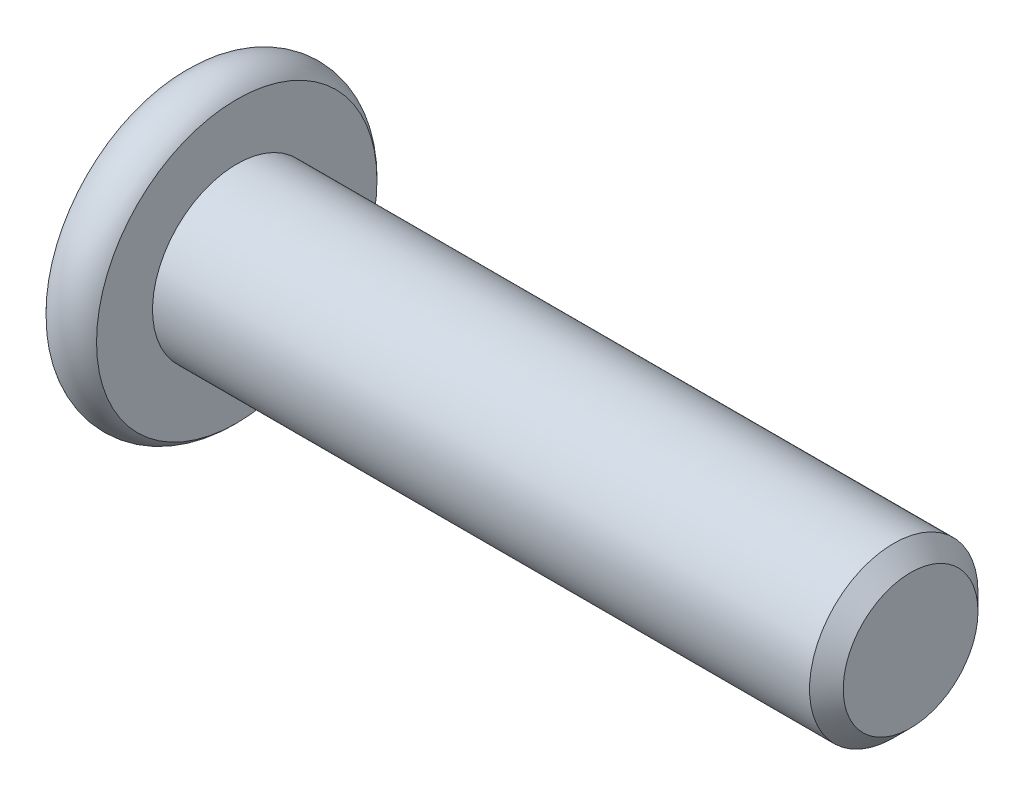
ISO-10303-21;
HEADER;
FILE_DESCRIPTION(('STEP AP214'),'2;1');
FILE_NAME('part.step','',(''),(''),'','','');
FILE_SCHEMA(('AUTOMOTIVE_DESIGN { 1 0 10303 214 1 1 1 1 }'));
ENDSEC;
DATA;
#1=APPLICATION_CONTEXT('core data for automotive mechanical design processes');
#2=APPLICATION_PROTOCOL_DEFINITION('international standard','automotive_design',2000,#1);
#3=PRODUCT_CONTEXT('',#1,'mechanical');
#4=PRODUCT('Part','Part','',(#3));
#5=PRODUCT_RELATED_PRODUCT_CATEGORY('part','',(#4));
#6=PRODUCT_DEFINITION_FORMATION('','',#4);
#7=PRODUCT_DEFINITION_CONTEXT('part definition',#1,'design');
#8=PRODUCT_DEFINITION('design','',#6,#7);
#9=PRODUCT_DEFINITION_SHAPE('','',#8);
#10=(LENGTH_UNIT() NAMED_UNIT(*) SI_UNIT(.MILLI.,.METRE.));
#11=(NAMED_UNIT(*) PLANE_ANGLE_UNIT() SI_UNIT($,.RADIAN.));
#12=(NAMED_UNIT(*) SI_UNIT($,.STERADIAN.) SOLID_ANGLE_UNIT());
#13=UNCERTAINTY_MEASURE_WITH_UNIT(LENGTH_MEASURE(1.E-05),#10,'distance_accuracy_value','');
#14=(GEOMETRIC_REPRESENTATION_CONTEXT(3) GLOBAL_UNCERTAINTY_ASSIGNED_CONTEXT((#13)) GLOBAL_UNIT_ASSIGNED_CONTEXT((#10,
#11,#12)) REPRESENTATION_CONTEXT('',''));
#15=CARTESIAN_POINT('',(0.,0.,0.));
#16=DIRECTION('',(0.,0.,1.));
#17=DIRECTION('',(1.,0.,0.));
#18=AXIS2_PLACEMENT_3D('',#15,#16,#17);
#19=CARTESIAN_POINT('',(-20.,0.,0.));
#20=DIRECTION('',(1.,0.,0.));
#21=DIRECTION('',(0.,0.,-1.));
#22=AXIS2_PLACEMENT_3D('',#19,#20,#21);
#23=CYLINDRICAL_SURFACE('',#22,2.5);
#24=CARTESIAN_POINT('',(-0.5,0.,0.));
#25=DIRECTION('',(1.,0.,0.));
#26=DIRECTION('',(0.,0.,-1.));
#27=AXIS2_PLACEMENT_3D('',#24,#25,#26);
#28=CIRCLE('',#27,2.5);
#29=CARTESIAN_POINT('',(-0.5,0.,-2.5));
#30=VERTEX_POINT('',#29);
#31=EDGE_CURVE('E55',#30,#30,#28,.F.);
#32=ORIENTED_EDGE('',*,*,#31,.T.);
#33=EDGE_LOOP('',(#32));
#34=FACE_BOUND('',#33,.T.);
#35=CARTESIAN_POINT('',(-20.,0.,0.));
#36=DIRECTION('',(-1.,0.,0.));
#37=DIRECTION('',(0.,-1.,0.));
#38=AXIS2_PLACEMENT_3D('',#35,#36,#37);
#39=CIRCLE('',#38,2.5);
#40=CARTESIAN_POINT('',(-20.,-2.50000000000001,0.));
#41=VERTEX_POINT('',#40);
#42=EDGE_CURVE('E131',#41,#41,#39,.F.);
#43=ORIENTED_EDGE('',*,*,#42,.T.);
#44=EDGE_LOOP('',(#43));
#45=FACE_BOUND('',#44,.T.);
#46=ADVANCED_FACE('F41',(#34,#45),#23,.T.);
#47=CARTESIAN_POINT('',(0.,0.,0.));
#48=DIRECTION('',(1.,0.,0.));
#49=DIRECTION('',(0.,0.,-1.));
#50=AXIS2_PLACEMENT_3D('',#47,#48,#49);
#51=PLANE('',#50);
#52=CARTESIAN_POINT('',(0.,0.,0.));
#53=DIRECTION('',(1.,0.,0.));
#54=DIRECTION('',(0.,0.,-1.));
#55=AXIS2_PLACEMENT_3D('',#52,#53,#54);
#56=CIRCLE('',#55,2.);
#57=CARTESIAN_POINT('',(0.,0.,-2.));
#58=VERTEX_POINT('',#57);
#59=EDGE_CURVE('E134',#58,#58,#56,.T.);
#60=ORIENTED_EDGE('',*,*,#59,.T.);
#61=EDGE_LOOP('',(#60));
#62=FACE_BOUND('',#61,.T.);
#63=ADVANCED_FACE('F144',(#62),#51,.T.);
#64=CARTESIAN_POINT('',(0.,0.,0.));
#65=DIRECTION('',(-1.,0.,0.));
#66=DIRECTION('',(0.,0.,1.));
#67=AXIS2_PLACEMENT_3D('',#64,#65,#66);
#68=CONICAL_SURFACE('',#67,2.,0.785398163397446);
#69=ORIENTED_EDGE('',*,*,#31,.F.);
#70=EDGE_LOOP('',(#69));
#71=FACE_BOUND('',#70,.T.);
#72=ORIENTED_EDGE('',*,*,#59,.F.);
#73=EDGE_LOOP('',(#72));
#74=FACE_BOUND('',#73,.T.);
#75=ADVANCED_FACE('F43',(#71,#74),#68,.T.);
#76=CARTESIAN_POINT('',(-21.5,0.,0.));
#77=DIRECTION('',(1.,0.,0.));
#78=DIRECTION('',(0.,1.,0.));
#79=AXIS2_PLACEMENT_3D('',#76,#77,#78);
#80=PLANE('',#79);
#81=CARTESIAN_POINT('',(-21.5,0.,0.));
#82=DIRECTION('',(-1.,0.,0.));
#83=DIRECTION('',(0.,-1.,0.));
#84=AXIS2_PLACEMENT_3D('',#81,#82,#83);
#85=CIRCLE('',#84,1.78205080756886);
#86=CARTESIAN_POINT('',(-21.5,-1.78205080756877,0.));
#87=VERTEX_POINT('',#86);
#88=EDGE_CURVE('E249',#87,#87,#85,.T.);
#89=ORIENTED_EDGE('',*,*,#88,.F.);
#90=EDGE_LOOP('',(#89));
#91=FACE_BOUND('',#90,.T.);
#92=CARTESIAN_POINT('',(-21.5,0.,0.));
#93=DIRECTION('',(-1.,0.,0.));
#94=DIRECTION('',(0.,-1.,0.));
#95=AXIS2_PLACEMENT_3D('',#92,#93,#94);
#96=CIRCLE('',#95,4.16143782776615);
#97=CARTESIAN_POINT('',(-21.5,-4.16143782776614,0.));
#98=VERTEX_POINT('',#97);
#99=EDGE_CURVE('E128',#98,#98,#96,.T.);
#100=ORIENTED_EDGE('',*,*,#99,.T.);
#101=EDGE_LOOP('',(#100));
#102=FACE_BOUND('',#101,.T.);
#103=ADVANCED_FACE('F143',(#91,#102),#80,.F.);
#104=CARTESIAN_POINT('',(-20.75,0.,0.));
#105=DIRECTION('',(-1.,0.,0.));
#106=DIRECTION('',(0.,-1.,0.));
#107=AXIS2_PLACEMENT_3D('',#104,#105,#106);
#108=TOROIDAL_SURFACE('',#107,3.5,1.);
#109=ORIENTED_EDGE('',*,*,#99,.F.);
#110=EDGE_LOOP('',(#109));
#111=FACE_BOUND('',#110,.T.);
#112=CARTESIAN_POINT('',(-20.,0.,0.));
#113=DIRECTION('',(-1.,0.,0.));
#114=DIRECTION('',(0.,-1.,0.));
#115=AXIS2_PLACEMENT_3D('',#112,#113,#114);
#116=CIRCLE('',#115,4.16143782776615);
#117=CARTESIAN_POINT('',(-20.,-4.16143782776615,0.));
#118=VERTEX_POINT('',#117);
#119=EDGE_CURVE('E125',#118,#118,#116,.T.);
#120=ORIENTED_EDGE('',*,*,#119,.T.);
#121=EDGE_LOOP('',(#120));
#122=FACE_BOUND('',#121,.T.);
#123=ADVANCED_FACE('F155',(#111,#122),#108,.T.);
#124=CARTESIAN_POINT('',(-20.,4.16143782776615,0.));
#125=DIRECTION('',(-1.,0.,0.));
#126=DIRECTION('',(0.,-1.,0.));
#127=AXIS2_PLACEMENT_3D('',#124,#125,#126);
#128=PLANE('',#127);
#129=ORIENTED_EDGE('',*,*,#42,.F.);
#130=EDGE_LOOP('',(#129));
#131=FACE_BOUND('',#130,.T.);
#132=ORIENTED_EDGE('',*,*,#119,.F.);
#133=EDGE_LOOP('',(#132));
#134=FACE_BOUND('',#133,.T.);
#135=ADVANCED_FACE('F159',(#131,#134),#128,.F.);
#136=CARTESIAN_POINT('',(-21.5,0.,0.));
#137=DIRECTION('',(-1.,0.,0.));
#138=DIRECTION('',(0.,-1.,0.));
#139=AXIS2_PLACEMENT_3D('',#136,#137,#138);
#140=CONICAL_SURFACE('',#139,1.78205080756886,0.78539816339745);
#141=ORIENTED_EDGE('',*,*,#88,.T.);
#142=EDGE_LOOP('',(#141));
#143=FACE_BOUND('',#142,.T.);
#144=CARTESIAN_POINT('',(-22.015428085613,-1.74023253176573,1.5));
#145=CARTESIAN_POINT('',(-21.9833811073445,-1.69791724929727,1.5));
#146=CARTESIAN_POINT('',(-21.9516444672841,-1.65536760966788,1.5));
#147=CARTESIAN_POINT('',(-21.8889203936153,-1.56970398156681,1.5));
#148=CARTESIAN_POINT('',(-21.85793314822,-1.52658985542845,1.5));
#149=CARTESIAN_POINT('',(-21.765846164345,-1.39562626326559,1.5));
#150=CARTESIAN_POINT('',(-21.7061145123021,-1.30679868010572,1.5));
#151=CARTESIAN_POINT('',(-21.5887342891012,-1.12044622640211,1.5));
#152=CARTESIAN_POINT('',(-21.5314082774823,-1.02271587306669,1.5));
#153=CARTESIAN_POINT('',(-21.426463214976,-0.822357214965219,1.5));
#154=CARTESIAN_POINT('',(-21.3788114236896,-0.719746931701882,1.5));
#155=CARTESIAN_POINT('',(-21.320509988315,-0.565852387095054,1.5));
#156=CARTESIAN_POINT('',(-21.3037990535409,-0.516874191424642,1.5));
#157=CARTESIAN_POINT('',(-21.2743077515089,-0.41772398845748,1.5));
#158=CARTESIAN_POINT('',(-21.2615276514219,-0.367551900263847,1.5));
#159=CARTESIAN_POINT('',(-21.2407784202458,-0.267158299056097,1.5));
#160=CARTESIAN_POINT('',(-21.2327260618259,-0.216954261864833,1.5));
#161=CARTESIAN_POINT('',(-21.221591636834,-0.115994915871297,1.5));
#162=CARTESIAN_POINT('',(-21.2185086886377,-0.0652397064615148,1.5));
#163=CARTESIAN_POINT('',(-21.2175473897404,0.0344222234875812,1.5));
#164=CARTESIAN_POINT('',(-21.2194789216952,0.0833271701101152,1.5));
#165=CARTESIAN_POINT('',(-21.2280175729677,0.180724293127248,1.5));
#166=CARTESIAN_POINT('',(-21.234625142048,0.229216429361756,1.5));
#167=CARTESIAN_POINT('',(-21.2522650626447,0.326258027697034,1.5));
#168=CARTESIAN_POINT('',(-21.263373168201,0.374793507450053,1.5));
#169=CARTESIAN_POINT('',(-21.2894198669595,0.470802295834207,1.5));
#170=CARTESIAN_POINT('',(-21.3043581560035,0.518275688481311,1.5));
#171=CARTESIAN_POINT('',(-21.356839545716,0.667150562065161,1.5));
#172=CARTESIAN_POINT('',(-21.4003351165442,0.766448362426881,1.5));
#173=CARTESIAN_POINT('',(-21.4970587814836,0.960384405673869,1.5));
#174=CARTESIAN_POINT('',(-21.5503217226675,1.05500437383624,1.5));
#175=CARTESIAN_POINT('',(-21.6602258010453,1.23584520321535,1.5));
#176=CARTESIAN_POINT('',(-21.7165682531046,1.32224986946553,1.5));
#177=CARTESIAN_POINT('',(-21.803675572597,1.44954953726477,1.5));
#178=CARTESIAN_POINT('',(-21.8330199906839,1.49143368482427,1.5));
#179=CARTESIAN_POINT('',(-21.8924869182931,1.57462914783248,1.5));
#180=CARTESIAN_POINT('',(-21.9226092115007,1.61594061772583,1.5));
#181=CARTESIAN_POINT('',(-21.9530541181366,1.65701358742556,1.5));
#182=B_SPLINE_CURVE_WITH_KNOTS('',3,(#144,#145,#146,#147,#148,#149,#150,#151,#152,#153,#154,
#155,#156,#157,#158,#159,#160,#161,#162,#163,#164,#165,#166,#167,#168,#169,#170,#171,#172,#173,
#174,#175,#176,#177,#178,#179,#180,#181),.UNSPECIFIED.,.F.,.F.,(4,2,2,2,2,2,2,2,2,2,2,2,2,2,2,2,
2,2,4),(0.,0.159238974218354,0.318517535014543,0.639504781932386,0.979137893799193,
1.31760168934357,1.47272233841624,1.62785352839775,1.78016486537346,1.93244917778279,
2.07904486260297,2.22565464958332,2.37484213303399,2.52401777304039,2.84828365283775,
3.1737297566675,3.48303030530537,3.63644667013909,3.78982082222913),.UNSPECIFIED.);
#183=CARTESIAN_POINT('',(-21.45,-0.866025403784357,1.5));
#184=VERTEX_POINT('',#183);
#185=CARTESIAN_POINT('',(-21.45,0.866025403784521,1.5));
#186=VERTEX_POINT('',#185);
#187=EDGE_CURVE('E109',#184,#186,#182,.T.);
#188=ORIENTED_EDGE('',*,*,#187,.F.);
#189=CARTESIAN_POINT('',(-21.4501154816001,-1.73216627762263,-0.0002000000000008));
#190=CARTESIAN_POINT('',(-21.4203654760674,-1.70239359975907,0.0513677907370744));
#191=CARTESIAN_POINT('',(-21.3923624839103,-1.67212305186347,0.103797917665199));
#192=CARTESIAN_POINT('',(-21.3410892304402,-1.61039789003611,0.210709034055595));
#193=CARTESIAN_POINT('',(-21.3178475050444,-1.57893740312606,0.26520019581466));
#194=CARTESIAN_POINT('',(-21.2780337289922,-1.51549879897979,0.375079081357248));
#195=CARTESIAN_POINT('',(-21.2613615856709,-1.48353684526802,0.430438809095199));
#196=CARTESIAN_POINT('',(-21.2356744568181,-1.41890915196203,0.54237725747715));
#197=CARTESIAN_POINT('',(-21.2266402904789,-1.3862453878111,0.598952556553009));
#198=CARTESIAN_POINT('',(-21.2184890812269,-1.32995210095291,0.696455389516442));
#199=CARTESIAN_POINT('',(-21.2172822529892,-1.30639533311116,0.737256908280467));
#200=CARTESIAN_POINT('',(-21.2193140571623,-1.25932335290185,0.818787969615859));
#201=CARTESIAN_POINT('',(-21.2225536707483,-1.23580815085305,0.859517494314631));
#202=CARTESIAN_POINT('',(-21.233291985982,-1.18900414978418,0.940584402163417));
#203=CARTESIAN_POINT('',(-21.2407946530188,-1.16571558211711,0.980921384598289));
#204=CARTESIAN_POINT('',(-21.2596516119283,-1.11952932016327,1.06091833691403));
#205=CARTESIAN_POINT('',(-21.2710075570186,-1.09663179808778,1.10057800851621));
#206=CARTESIAN_POINT('',(-21.3047216475927,-1.0379815980969,1.20216313477449));
#207=CARTESIAN_POINT('',(-21.3296218490934,-1.00259267147457,1.26345855370969));
#208=CARTESIAN_POINT('',(-21.3716566532716,-0.950557780604292,1.35358562846331));
#209=CARTESIAN_POINT('',(-21.3864251535591,-0.933410759677065,1.38328513990772));
#210=CARTESIAN_POINT('',(-21.4173105659402,-0.899432101996325,1.44213790138375));
#211=CARTESIAN_POINT('',(-21.4334268341217,-0.882600319285629,1.47129140422064));
#212=CARTESIAN_POINT('',(-21.4501154816001,-0.865909933730519,1.5002));
#213=B_SPLINE_CURVE_WITH_KNOTS('',3,(#189,#190,#191,#192,#193,#194,#195,#196,#197,#198,#199,
#200,#201,#202,#203,#204,#205,#206,#207,#208,#209,#210,#211,#212),.UNSPECIFIED.,.F.,.F.,(4,2,2,
2,2,2,2,2,2,2,2,4),(0.,0.199829143693305,0.400822987382389,0.598623720538181,0.795926240188891,
0.937113067959883,1.07833105577193,1.21968061668222,1.36109089931055,1.58570969637566,
1.69770705470964,1.80965120737194),.UNSPECIFIED.);
#214=CARTESIAN_POINT('',(-21.45,-1.73205080756879,0.));
#215=VERTEX_POINT('',#214);
#216=EDGE_CURVE('E205',#215,#184,#213,.T.);
#217=ORIENTED_EDGE('',*,*,#216,.F.);
#218=CARTESIAN_POINT('',(-21.4501154816001,-0.865909933730519,-1.5002));
#219=CARTESIAN_POINT('',(-21.4203654760674,-0.895682611594084,-1.44863220926292));
#220=CARTESIAN_POINT('',(-21.3923624839103,-0.925953159489683,-1.3962020823348));
#221=CARTESIAN_POINT('',(-21.3410892304402,-0.987678321317041,-1.2892909659444));
#222=CARTESIAN_POINT('',(-21.3178475050444,-1.01913880822709,-1.23479980418534));
#223=CARTESIAN_POINT('',(-21.2780337289922,-1.08257741237336,-1.12492091864275));
#224=CARTESIAN_POINT('',(-21.2613615856709,-1.11453936608513,-1.0695611909048));
#225=CARTESIAN_POINT('',(-21.2356744568181,-1.17916705939112,-0.957622742522851));
#226=CARTESIAN_POINT('',(-21.2266402904789,-1.21183082354205,-0.901047443446993));
#227=CARTESIAN_POINT('',(-21.2184890812269,-1.26812411040024,-0.80354461048356));
#228=CARTESIAN_POINT('',(-21.2172822529892,-1.291680878242,-0.762743091719535));
#229=CARTESIAN_POINT('',(-21.2193140571623,-1.3387528584513,-0.681212030384143));
#230=CARTESIAN_POINT('',(-21.2225536707483,-1.3622680605001,-0.640482505685371));
#231=CARTESIAN_POINT('',(-21.233291985982,-1.40907206156897,-0.559415597836585));
#232=CARTESIAN_POINT('',(-21.2407946530188,-1.43236062923604,-0.519078615401714));
#233=CARTESIAN_POINT('',(-21.2596516119283,-1.47854689118988,-0.439081663085971));
#234=CARTESIAN_POINT('',(-21.2710075570186,-1.50144441326537,-0.399421991483794));
#235=CARTESIAN_POINT('',(-21.3047216475927,-1.56009461325625,-0.297836865225517));
#236=CARTESIAN_POINT('',(-21.3296218490934,-1.59548353987858,-0.236541446290313));
#237=CARTESIAN_POINT('',(-21.3716566532716,-1.64751843074886,-0.146414371536688));
#238=CARTESIAN_POINT('',(-21.3864251535591,-1.66466545167609,-0.116714860092285));
#239=CARTESIAN_POINT('',(-21.4173105659402,-1.69864410935683,-0.0578620986162509));
#240=CARTESIAN_POINT('',(-21.4334268341217,-1.71547589206752,-0.0287085957793639));
#241=CARTESIAN_POINT('',(-21.4501154816001,-1.73216627762263,0.00019999999999943));
#242=B_SPLINE_CURVE_WITH_KNOTS('',3,(#218,#219,#220,#221,#222,#223,#224,#225,#226,#227,#228,
#229,#230,#231,#232,#233,#234,#235,#236,#237,#238,#239,#240,#241),.UNSPECIFIED.,.F.,.F.,(4,2,2,
2,2,2,2,2,2,2,2,4),(0.,0.199829143693304,0.400822987382386,0.598623720538178,0.795926240188888,
0.937113067959879,1.07833105577193,1.21968061668222,1.36109089931054,1.58570969637565,
1.69770705470963,1.80965120737194),.UNSPECIFIED.);
#243=CARTESIAN_POINT('',(-21.45,-0.866025403784356,-1.5));
#244=VERTEX_POINT('',#243);
#245=EDGE_CURVE('E199',#244,#215,#242,.T.);
#246=ORIENTED_EDGE('',*,*,#245,.F.);
#247=CARTESIAN_POINT('',(-22.0154280857208,-1.74023253190806,-1.5));
#248=CARTESIAN_POINT('',(-21.9833811074482,-1.69791724943558,-1.5));
#249=CARTESIAN_POINT('',(-21.9516444673836,-1.65536760980217,-1.5));
#250=CARTESIAN_POINT('',(-21.8889203937065,-1.569703981693,-1.5));
#251=CARTESIAN_POINT('',(-21.8579331483071,-1.52658985555058,-1.5));
#252=CARTESIAN_POINT('',(-21.7658461644196,-1.39562626337528,-1.5));
#253=CARTESIAN_POINT('',(-21.7061145123685,-1.30679868020694,-1.5));
#254=CARTESIAN_POINT('',(-21.5887342891506,-1.12044622648488,-1.5));
#255=CARTESIAN_POINT('',(-21.5314082775229,-1.02271587313942,-1.5));
#256=CARTESIAN_POINT('',(-21.4264632150005,-0.822357215017008,-1.5));
#257=CARTESIAN_POINT('',(-21.3788114237068,-0.719746931742781,-1.5));
#258=CARTESIAN_POINT('',(-21.3205099883267,-0.565852387127772,-1.5));
#259=CARTESIAN_POINT('',(-21.3037990535528,-0.516874191460807,-1.5));
#260=CARTESIAN_POINT('',(-21.2743077515206,-0.417723988500656,-1.5));
#261=CARTESIAN_POINT('',(-21.2615276514332,-0.367551900310585,-1.5));
#262=CARTESIAN_POINT('',(-21.2407784202553,-0.267158299109846,-1.5));
#263=CARTESIAN_POINT('',(-21.2327260618343,-0.216954261922027,-1.5));
#264=CARTESIAN_POINT('',(-21.2215916368391,-0.11599491593527,-1.5));
#265=CARTESIAN_POINT('',(-21.2185086886407,-0.0652397065288216,-1.5));
#266=CARTESIAN_POINT('',(-21.2175473897388,0.0344222234142057,-1.5));
#267=CARTESIAN_POINT('',(-21.219478921691,0.0833271700339959,-1.5));
#268=CARTESIAN_POINT('',(-21.228017572958,0.18072429304592,-1.5));
#269=CARTESIAN_POINT('',(-21.2346251420354,0.229216429277964,-1.5));
#270=CARTESIAN_POINT('',(-21.2522650626259,0.326258027608378,-1.5));
#271=CARTESIAN_POINT('',(-21.2633731681789,0.374793507359005,-1.5));
#272=CARTESIAN_POINT('',(-21.2894198669309,0.470802295738608,-1.5));
#273=CARTESIAN_POINT('',(-21.3043581559716,0.518275688383553,-1.5));
#274=CARTESIAN_POINT('',(-21.3568395456685,0.667150561946207,-1.5));
#275=CARTESIAN_POINT('',(-21.4003351164824,0.766448362289951,-1.5));
#276=CARTESIAN_POINT('',(-21.4970587813916,0.960384405502367,-1.5));
#277=CARTESIAN_POINT('',(-21.5503217225595,1.05500437364815,-1.5));
#278=CARTESIAN_POINT('',(-21.6602258009069,1.23584520299745,-1.5));
#279=CARTESIAN_POINT('',(-21.7165682529518,1.32224986923429,-1.5));
#280=CARTESIAN_POINT('',(-21.8036755724226,1.44954953701381,-1.5));
#281=CARTESIAN_POINT('',(-21.8330199905024,1.49143368456684,-1.5));
#282=CARTESIAN_POINT('',(-21.8924869180973,1.57462914756214,-1.5));
#283=CARTESIAN_POINT('',(-21.9226092112979,1.61594061744905,-1.5));
#284=CARTESIAN_POINT('',(-21.9530541179266,1.65701358714236,-1.5));
#285=B_SPLINE_CURVE_WITH_KNOTS('',3,(#247,#248,#249,#250,#251,#252,#253,#254,#255,#256,#257,
#258,#259,#260,#261,#262,#263,#264,#265,#266,#267,#268,#269,#270,#271,#272,#273,#274,#275,#276,
#277,#278,#279,#280,#281,#282,#283,#284),.UNSPECIFIED.,.F.,.F.,(4,2,2,2,2,2,2,2,2,2,2,2,2,2,2,2,
2,2,4),(0.,0.159238974235481,0.318517535048797,0.63950478200154,0.979137893907506,
1.31760168949067,1.47272233855334,1.62785352852489,1.78016486549104,1.93244917789081,
2.0790448627025,2.22565464967435,2.37484213311584,2.52401777311309,2.8482836528441,
3.17372975660706,3.4830303051878,3.63644666999334,3.78982082205521),.UNSPECIFIED.);
#286=CARTESIAN_POINT('',(-21.45,0.866025403784521,-1.5));
#287=VERTEX_POINT('',#286);
#288=EDGE_CURVE('E62',#287,#244,#285,.F.);
#289=ORIENTED_EDGE('',*,*,#288,.F.);
#290=CARTESIAN_POINT('',(-21.4501154816001,1.7321662776228,0.00020000000000003));
#291=CARTESIAN_POINT('',(-21.4203654760673,1.70239359975923,-0.0513677907370759));
#292=CARTESIAN_POINT('',(-21.3923624839103,1.67212305186363,-0.103797917665201));
#293=CARTESIAN_POINT('',(-21.3410892304402,1.61039789003627,-0.210709034055597));
#294=CARTESIAN_POINT('',(-21.3178475050444,1.57893740312622,-0.265200195814661));
#295=CARTESIAN_POINT('',(-21.2780337289922,1.51549879897995,-0.375079081357247));
#296=CARTESIAN_POINT('',(-21.2613615856709,1.48353684526818,-0.430438809095198));
#297=CARTESIAN_POINT('',(-21.2356744568181,1.4189091519622,-0.542377257477149));
#298=CARTESIAN_POINT('',(-21.2266402904789,1.38624538781127,-0.598952556553007));
#299=CARTESIAN_POINT('',(-21.2184890812269,1.32995210095308,-0.696455389516439));
#300=CARTESIAN_POINT('',(-21.2172822529892,1.30639533311132,-0.737256908280464));
#301=CARTESIAN_POINT('',(-21.2193140571623,1.25932335290202,-0.818787969615856));
#302=CARTESIAN_POINT('',(-21.2225536707483,1.23580815085322,-0.859517494314628));
#303=CARTESIAN_POINT('',(-21.233291985982,1.18900414978435,-0.940584402163414));
#304=CARTESIAN_POINT('',(-21.2407946530187,1.16571558211728,-0.980921384598287));
#305=CARTESIAN_POINT('',(-21.2596516119283,1.11952932016343,-1.06091833691403));
#306=CARTESIAN_POINT('',(-21.2710075570186,1.09663179808795,-1.10057800851621));
#307=CARTESIAN_POINT('',(-21.3047216475927,1.03798159809707,-1.20216313477448));
#308=CARTESIAN_POINT('',(-21.3296218490934,1.00259267147474,-1.26345855370969));
#309=CARTESIAN_POINT('',(-21.3716566532716,0.950557780604457,-1.35358562846331));
#310=CARTESIAN_POINT('',(-21.3864251535591,0.93341075967723,-1.38328513990772));
#311=CARTESIAN_POINT('',(-21.4173105659402,0.89943210199649,-1.44213790138375));
#312=CARTESIAN_POINT('',(-21.4334268341217,0.882600319285793,-1.47129140422064));
#313=CARTESIAN_POINT('',(-21.4501154816001,0.865909933730683,-1.5002));
#314=B_SPLINE_CURVE_WITH_KNOTS('',3,(#290,#291,#292,#293,#294,#295,#296,#297,#298,#299,#300,
#301,#302,#303,#304,#305,#306,#307,#308,#309,#310,#311,#312,#313),.UNSPECIFIED.,.F.,.F.,(4,2,2,
2,2,2,2,2,2,2,2,4),(0.,0.199829143693305,0.400822987382387,0.598623720538179,0.795926240188887,
0.937113067959879,1.07833105577193,1.21968061668222,1.36109089931054,1.58570969637565,
1.69770705470963,1.80965120737194),.UNSPECIFIED.);
#315=CARTESIAN_POINT('',(-21.45,1.73205080756896,0.));
#316=VERTEX_POINT('',#315);
#317=EDGE_CURVE('E11',#316,#287,#314,.T.);
#318=ORIENTED_EDGE('',*,*,#317,.F.);
#319=CARTESIAN_POINT('',(-21.4501154816001,0.865909933730683,1.5002));
#320=CARTESIAN_POINT('',(-21.4203654760673,0.895682611594248,1.44863220926292));
#321=CARTESIAN_POINT('',(-21.3923624839103,0.925953159489847,1.3962020823348));
#322=CARTESIAN_POINT('',(-21.3410892304402,0.987678321317206,1.2892909659444));
#323=CARTESIAN_POINT('',(-21.3178475050444,1.01913880822726,1.23479980418534));
#324=CARTESIAN_POINT('',(-21.2780337289922,1.08257741237353,1.12492091864275));
#325=CARTESIAN_POINT('',(-21.2613615856709,1.1145393660853,1.0695611909048));
#326=CARTESIAN_POINT('',(-21.2356744568181,1.17916705939129,0.957622742522847));
#327=CARTESIAN_POINT('',(-21.2266402904789,1.21183082354222,0.901047443446989));
#328=CARTESIAN_POINT('',(-21.2184890812269,1.2681241104004,0.803544610483557));
#329=CARTESIAN_POINT('',(-21.2172822529892,1.29168087824216,0.762743091719531));
#330=CARTESIAN_POINT('',(-21.2193140571623,1.33875285845146,0.681212030384139));
#331=CARTESIAN_POINT('',(-21.2225536707483,1.36226806050027,0.640482505685368));
#332=CARTESIAN_POINT('',(-21.233291985982,1.40907206156913,0.559415597836582));
#333=CARTESIAN_POINT('',(-21.2407946530187,1.4323606292362,0.51907861540171));
#334=CARTESIAN_POINT('',(-21.2596516119283,1.47854689119005,0.439081663085967));
#335=CARTESIAN_POINT('',(-21.2710075570186,1.50144441326554,0.39942199148379));
#336=CARTESIAN_POINT('',(-21.3047216475927,1.56009461325641,0.297836865225514));
#337=CARTESIAN_POINT('',(-21.3296218490934,1.59548353987875,0.23654144629031));
#338=CARTESIAN_POINT('',(-21.3716566532716,1.64751843074902,0.146414371536686));
#339=CARTESIAN_POINT('',(-21.3864251535591,1.66466545167625,0.116714860092283));
#340=CARTESIAN_POINT('',(-21.4173105659402,1.69864410935699,0.05786209861625));
#341=CARTESIAN_POINT('',(-21.4334268341217,1.71547589206769,0.0287085957793637));
#342=CARTESIAN_POINT('',(-21.4501154816001,1.7321662776228,-0.000199999999999372));
#343=B_SPLINE_CURVE_WITH_KNOTS('',3,(#319,#320,#321,#322,#323,#324,#325,#326,#327,#328,#329,
#330,#331,#332,#333,#334,#335,#336,#337,#338,#339,#340,#341,#342),.UNSPECIFIED.,.F.,.F.,(4,2,2,
2,2,2,2,2,2,2,2,4),(0.,0.199829143693306,0.40082298738239,0.598623720538183,0.795926240188891,
0.937113067959883,1.07833105577193,1.21968061668222,1.36109089931055,1.58570969637565,
1.69770705470963,1.80965120737193),.UNSPECIFIED.);
#344=EDGE_CURVE('E100',#186,#316,#343,.T.);
#345=ORIENTED_EDGE('',*,*,#344,.F.);
#346=EDGE_LOOP('',(#188,#217,#246,#289,#318,#345));
#347=FACE_BOUND('',#346,.T.);
#348=ADVANCED_FACE('F99',(#143,#347),#140,.F.);
#349=CARTESIAN_POINT('',(-19.2,0.,0.));
#350=DIRECTION('',(-1.,0.,0.));
#351=DIRECTION('',(0.,-1.,0.));
#352=AXIS2_PLACEMENT_3D('',#349,#350,#351);
#353=PLANE('',#352);
#354=DIRECTION('',(0.,0.5,-0.866025403784438));
#355=VECTOR('',#354,1.);
#356=CARTESIAN_POINT('',(-19.2,0.866025403784512,1.5));
#357=LINE('',#356,#355);
#358=CARTESIAN_POINT('',(-19.2,0.866025403784512,1.5));
#359=VERTEX_POINT('',#358);
#360=CARTESIAN_POINT('',(-19.2,1.73205080756895,0.));
#361=VERTEX_POINT('',#360);
#362=EDGE_CURVE('E108',#359,#361,#357,.T.);
#363=ORIENTED_EDGE('',*,*,#362,.T.);
#364=DIRECTION('',(0.,-0.5,-0.866025403784439));
#365=VECTOR('',#364,1.);
#366=CARTESIAN_POINT('',(-19.2,1.73205080756895,0.));
#367=LINE('',#366,#365);
#368=CARTESIAN_POINT('',(-19.2,0.866025403784512,-1.5));
#369=VERTEX_POINT('',#368);
#370=EDGE_CURVE('E113',#361,#369,#367,.T.);
#371=ORIENTED_EDGE('',*,*,#370,.T.);
#372=DIRECTION('',(0.,-1.,0.));
#373=VECTOR('',#372,1.);
#374=CARTESIAN_POINT('',(-19.2,0.866025403784512,-1.5));
#375=LINE('',#374,#373);
#376=CARTESIAN_POINT('',(-19.2,-0.866025403784365,-1.5));
#377=VERTEX_POINT('',#376);
#378=EDGE_CURVE('E231',#369,#377,#375,.T.);
#379=ORIENTED_EDGE('',*,*,#378,.T.);
#380=DIRECTION('',(0.,-0.5,0.866025403784439));
#381=VECTOR('',#380,1.);
#382=CARTESIAN_POINT('',(-19.2,-0.866025403784365,-1.5));
#383=LINE('',#382,#381);
#384=CARTESIAN_POINT('',(-19.2,-1.7320508075688,0.));
#385=VERTEX_POINT('',#384);
#386=EDGE_CURVE('E235',#377,#385,#383,.T.);
#387=ORIENTED_EDGE('',*,*,#386,.T.);
#388=DIRECTION('',(0.,0.5,0.866025403784439));
#389=VECTOR('',#388,1.);
#390=CARTESIAN_POINT('',(-19.2,-1.7320508075688,0.));
#391=LINE('',#390,#389);
#392=CARTESIAN_POINT('',(-19.2,-0.866025403784366,1.5));
#393=VERTEX_POINT('',#392);
#394=EDGE_CURVE('E121',#385,#393,#391,.T.);
#395=ORIENTED_EDGE('',*,*,#394,.T.);
#396=DIRECTION('',(0.,1.,0.));
#397=VECTOR('',#396,1.);
#398=CARTESIAN_POINT('',(-19.2,-0.866025403784366,1.5));
#399=LINE('',#398,#397);
#400=EDGE_CURVE('E116',#393,#359,#399,.T.);
#401=ORIENTED_EDGE('',*,*,#400,.T.);
#402=EDGE_LOOP('',(#363,#371,#379,#387,#395,#401));
#403=FACE_BOUND('',#402,.T.);
#404=ADVANCED_FACE('F185',(#403),#353,.T.);
#405=CARTESIAN_POINT('',(-19.2,1.73205080756895,0.));
#406=DIRECTION('',(0.,0.866025403784439,-0.5));
#407=DIRECTION('',(0.,0.5,0.866025403784439));
#408=AXIS2_PLACEMENT_3D('',#405,#406,#407);
#409=PLANE('',#408);
#410=DIRECTION('',(-1.,0.,0.));
#411=VECTOR('',#410,1.);
#412=CARTESIAN_POINT('',(-19.2,1.73205080756895,0.));
#413=LINE('',#412,#411);
#414=EDGE_CURVE('E106',#361,#316,#413,.T.);
#415=ORIENTED_EDGE('',*,*,#414,.T.);
#416=ORIENTED_EDGE('',*,*,#317,.T.);
#417=DIRECTION('',(-1.,0.,0.));
#418=VECTOR('',#417,1.);
#419=CARTESIAN_POINT('',(-19.2,0.866025403784512,-1.5));
#420=LINE('',#419,#418);
#421=EDGE_CURVE('E115',#369,#287,#420,.T.);
#422=ORIENTED_EDGE('',*,*,#421,.F.);
#423=ORIENTED_EDGE('',*,*,#370,.F.);
#424=EDGE_LOOP('',(#415,#416,#422,#423));
#425=FACE_BOUND('',#424,.T.);
#426=ADVANCED_FACE('F111',(#425),#409,.F.);
#427=CARTESIAN_POINT('',(-19.2,0.866025403784512,-1.5));
#428=DIRECTION('',(0.,0.,-1.));
#429=DIRECTION('',(0.,1.,0.));
#430=AXIS2_PLACEMENT_3D('',#427,#428,#429);
#431=PLANE('',#430);
#432=ORIENTED_EDGE('',*,*,#421,.T.);
#433=ORIENTED_EDGE('',*,*,#288,.T.);
#434=DIRECTION('',(-1.,0.,0.));
#435=VECTOR('',#434,1.);
#436=CARTESIAN_POINT('',(-19.2,-0.866025403784365,-1.5));
#437=LINE('',#436,#435);
#438=EDGE_CURVE('E118',#377,#244,#437,.T.);
#439=ORIENTED_EDGE('',*,*,#438,.F.);
#440=ORIENTED_EDGE('',*,*,#378,.F.);
#441=EDGE_LOOP('',(#432,#433,#439,#440));
#442=FACE_BOUND('',#441,.T.);
#443=ADVANCED_FACE('F220',(#442),#431,.F.);
#444=CARTESIAN_POINT('',(-19.2,-0.866025403784365,-1.5));
#445=DIRECTION('',(0.,-0.866025403784439,-0.5));
#446=DIRECTION('',(0.,0.5,-0.866025403784439));
#447=AXIS2_PLACEMENT_3D('',#444,#445,#446);
#448=PLANE('',#447);
#449=ORIENTED_EDGE('',*,*,#438,.T.);
#450=ORIENTED_EDGE('',*,*,#245,.T.);
#451=DIRECTION('',(-1.,0.,0.));
#452=VECTOR('',#451,1.);
#453=CARTESIAN_POINT('',(-19.2,-1.7320508075688,0.));
#454=LINE('',#453,#452);
#455=EDGE_CURVE('E245',#385,#215,#454,.T.);
#456=ORIENTED_EDGE('',*,*,#455,.F.);
#457=ORIENTED_EDGE('',*,*,#386,.F.);
#458=EDGE_LOOP('',(#449,#450,#456,#457));
#459=FACE_BOUND('',#458,.T.);
#460=ADVANCED_FACE('F215',(#459),#448,.F.);
#461=CARTESIAN_POINT('',(-19.2,-1.7320508075688,0.));
#462=DIRECTION('',(0.,-0.866025403784439,0.5));
#463=DIRECTION('',(0.,-0.5,-0.866025403784439));
#464=AXIS2_PLACEMENT_3D('',#461,#462,#463);
#465=PLANE('',#464);
#466=ORIENTED_EDGE('',*,*,#455,.T.);
#467=ORIENTED_EDGE('',*,*,#216,.T.);
#468=DIRECTION('',(-1.,0.,0.));
#469=VECTOR('',#468,1.);
#470=CARTESIAN_POINT('',(-19.2,-0.866025403784366,1.5));
#471=LINE('',#470,#469);
#472=EDGE_CURVE('E242',#393,#184,#471,.T.);
#473=ORIENTED_EDGE('',*,*,#472,.F.);
#474=ORIENTED_EDGE('',*,*,#394,.F.);
#475=EDGE_LOOP('',(#466,#467,#473,#474));
#476=FACE_BOUND('',#475,.T.);
#477=ADVANCED_FACE('F212',(#476),#465,.F.);
#478=CARTESIAN_POINT('',(-19.2,-0.866025403784366,1.5));
#479=DIRECTION('',(0.,0.,1.));
#480=DIRECTION('',(1.,0.,0.));
#481=AXIS2_PLACEMENT_3D('',#478,#479,#480);
#482=PLANE('',#481);
#483=ORIENTED_EDGE('',*,*,#472,.T.);
#484=ORIENTED_EDGE('',*,*,#187,.T.);
#485=DIRECTION('',(-1.,0.,0.));
#486=VECTOR('',#485,1.);
#487=CARTESIAN_POINT('',(-19.2,0.866025403784512,1.5));
#488=LINE('',#487,#486);
#489=EDGE_CURVE('E69',#359,#186,#488,.T.);
#490=ORIENTED_EDGE('',*,*,#489,.F.);
#491=ORIENTED_EDGE('',*,*,#400,.F.);
#492=EDGE_LOOP('',(#483,#484,#490,#491));
#493=FACE_BOUND('',#492,.T.);
#494=ADVANCED_FACE('F166',(#493),#482,.F.);
#495=CARTESIAN_POINT('',(-19.2,0.866025403784512,1.5));
#496=DIRECTION('',(0.,0.866025403784439,0.5));
#497=DIRECTION('',(0.,-0.5,0.866025403784439));
#498=AXIS2_PLACEMENT_3D('',#495,#496,#497);
#499=PLANE('',#498);
#500=ORIENTED_EDGE('',*,*,#489,.T.);
#501=ORIENTED_EDGE('',*,*,#344,.T.);
#502=ORIENTED_EDGE('',*,*,#414,.F.);
#503=ORIENTED_EDGE('',*,*,#362,.F.);
#504=EDGE_LOOP('',(#500,#501,#502,#503));
#505=FACE_BOUND('',#504,.T.);
#506=ADVANCED_FACE('F105',(#505),#499,.F.);
#507=CLOSED_SHELL('',(#46,#63,#75,#103,#123,#135,#348,#404,#426,#443,#460,#477,#494,#506));
#508=MANIFOLD_SOLID_BREP('B2',#507);
#509=ADVANCED_BREP_SHAPE_REPRESENTATION('',(#18,#508),#14);
#510=SHAPE_DEFINITION_REPRESENTATION(#9,#509);
ENDSEC;
END-ISO-10303-21;
